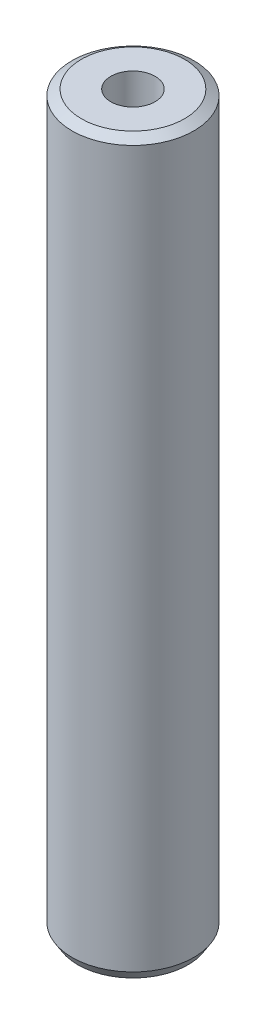
ISO-10303-21;
HEADER;
FILE_DESCRIPTION(('STEP AP214'),'2;1');
FILE_NAME('part.step','',(''),(''),'','','');
FILE_SCHEMA(('AUTOMOTIVE_DESIGN { 1 0 10303 214 1 1 1 1 }'));
ENDSEC;
DATA;
#1=APPLICATION_CONTEXT('core data for automotive mechanical design processes');
#2=APPLICATION_PROTOCOL_DEFINITION('international standard','automotive_design',2000,#1);
#3=PRODUCT_CONTEXT('',#1,'mechanical');
#4=PRODUCT('Part','Part','',(#3));
#5=PRODUCT_RELATED_PRODUCT_CATEGORY('part','',(#4));
#6=PRODUCT_DEFINITION_FORMATION('','',#4);
#7=PRODUCT_DEFINITION_CONTEXT('part definition',#1,'design');
#8=PRODUCT_DEFINITION('design','',#6,#7);
#9=PRODUCT_DEFINITION_SHAPE('','',#8);
#10=(LENGTH_UNIT() NAMED_UNIT(*) SI_UNIT(.MILLI.,.METRE.));
#11=(NAMED_UNIT(*) PLANE_ANGLE_UNIT() SI_UNIT($,.RADIAN.));
#12=(NAMED_UNIT(*) SI_UNIT($,.STERADIAN.) SOLID_ANGLE_UNIT());
#13=UNCERTAINTY_MEASURE_WITH_UNIT(LENGTH_MEASURE(1.E-05),#10,'distance_accuracy_value','');
#14=(GEOMETRIC_REPRESENTATION_CONTEXT(3) GLOBAL_UNCERTAINTY_ASSIGNED_CONTEXT((#13)) GLOBAL_UNIT_ASSIGNED_CONTEXT((#10,
#11,#12)) REPRESENTATION_CONTEXT('',''));
#15=CARTESIAN_POINT('',(0.,0.,0.));
#16=DIRECTION('',(0.,0.,1.));
#17=DIRECTION('',(1.,0.,0.));
#18=AXIS2_PLACEMENT_3D('',#15,#16,#17);
#19=CARTESIAN_POINT('',(0.,600.,0.));
#20=DIRECTION('',(0.,-1.,0.));
#21=DIRECTION('',(0.,0.,-1.));
#22=AXIS2_PLACEMENT_3D('',#19,#20,#21);
#23=CYLINDRICAL_SURFACE('',#22,50.);
#24=CARTESIAN_POINT('',(0.,595.227838809835,0.));
#25=DIRECTION('',(0.,1.,0.));
#26=DIRECTION('',(0.,0.,1.));
#27=AXIS2_PLACEMENT_3D('',#24,#25,#26);
#28=CIRCLE('',#27,50.);
#29=CARTESIAN_POINT('',(0.,595.227838809835,50.));
#30=VERTEX_POINT('',#29);
#31=EDGE_CURVE('E50',#30,#30,#28,.F.);
#32=ORIENTED_EDGE('',*,*,#31,.T.);
#33=EDGE_LOOP('',(#32));
#34=FACE_BOUND('',#33,.T.);
#35=CARTESIAN_POINT('',(0.,7.67058723065217,0.));
#36=DIRECTION('',(0.,1.,0.));
#37=DIRECTION('',(0.,0.,1.));
#38=AXIS2_PLACEMENT_3D('',#35,#36,#37);
#39=CIRCLE('',#38,50.);
#40=CARTESIAN_POINT('',(0.,7.67058723065217,50.));
#41=VERTEX_POINT('',#40);
#42=EDGE_CURVE('E51',#41,#41,#39,.T.);
#43=ORIENTED_EDGE('',*,*,#42,.T.);
#44=EDGE_LOOP('',(#43));
#45=FACE_BOUND('',#44,.T.);
#46=ADVANCED_FACE('F39',(#34,#45),#23,.T.);
#47=CARTESIAN_POINT('',(0.,600.,0.));
#48=DIRECTION('',(0.,1.,0.));
#49=DIRECTION('',(0.,0.,1.));
#50=AXIS2_PLACEMENT_3D('',#47,#48,#49);
#51=PLANE('',#50);
#52=CARTESIAN_POINT('',(0.,600.,0.));
#53=DIRECTION('',(0.,1.,0.));
#54=DIRECTION('',(0.,0.,1.));
#55=AXIS2_PLACEMENT_3D('',#52,#53,#54);
#56=CIRCLE('',#55,42.3294127693475);
#57=CARTESIAN_POINT('',(0.,600.,42.3294127693475));
#58=VERTEX_POINT('',#57);
#59=EDGE_CURVE('E54',#58,#58,#56,.T.);
#60=ORIENTED_EDGE('',*,*,#59,.T.);
#61=EDGE_LOOP('',(#60));
#62=FACE_BOUND('',#61,.T.);
#63=CARTESIAN_POINT('',(0.,600.,0.));
#64=DIRECTION('',(0.,1.,0.));
#65=DIRECTION('',(0.,0.,1.));
#66=AXIS2_PLACEMENT_3D('',#63,#64,#65);
#67=CIRCLE('',#66,18.1611144088573);
#68=CARTESIAN_POINT('',(0.,600.,18.1611144088573));
#69=VERTEX_POINT('',#68);
#70=EDGE_CURVE('E58',#69,#69,#67,.T.);
#71=ORIENTED_EDGE('',*,*,#70,.F.);
#72=EDGE_LOOP('',(#71));
#73=FACE_BOUND('',#72,.T.);
#74=ADVANCED_FACE('F69',(#62,#73),#51,.T.);
#75=CARTESIAN_POINT('',(0.,0.,0.));
#76=DIRECTION('',(0.,1.,0.));
#77=DIRECTION('',(0.,0.,1.));
#78=AXIS2_PLACEMENT_3D('',#75,#76,#77);
#79=PLANE('',#78);
#80=CARTESIAN_POINT('',(0.,0.,0.));
#81=DIRECTION('',(0.,1.,0.));
#82=DIRECTION('',(0.,0.,1.));
#83=AXIS2_PLACEMENT_3D('',#80,#81,#82);
#84=CIRCLE('',#83,45.2278388098354);
#85=CARTESIAN_POINT('',(0.,0.,45.2278388098354));
#86=VERTEX_POINT('',#85);
#87=EDGE_CURVE('E10',#86,#86,#84,.F.);
#88=ORIENTED_EDGE('',*,*,#87,.T.);
#89=EDGE_LOOP('',(#88));
#90=FACE_BOUND('',#89,.T.);
#91=CARTESIAN_POINT('',(0.,0.,0.));
#92=DIRECTION('',(0.,1.,0.));
#93=DIRECTION('',(0.,0.,1.));
#94=AXIS2_PLACEMENT_3D('',#91,#92,#93);
#95=CIRCLE('',#94,18.1611144088573);
#96=CARTESIAN_POINT('',(0.,0.,18.1611144088573));
#97=VERTEX_POINT('',#96);
#98=EDGE_CURVE('E63',#97,#97,#95,.T.);
#99=ORIENTED_EDGE('',*,*,#98,.T.);
#100=EDGE_LOOP('',(#99));
#101=FACE_BOUND('',#100,.T.);
#102=ADVANCED_FACE('F75',(#90,#101),#79,.F.);
#103=CARTESIAN_POINT('',(0.,600.,0.));
#104=DIRECTION('',(0.,-1.,0.));
#105=DIRECTION('',(0.,0.,-1.));
#106=AXIS2_PLACEMENT_3D('',#103,#104,#105);
#107=CYLINDRICAL_SURFACE('',#106,18.1611144088573);
#108=ORIENTED_EDGE('',*,*,#70,.T.);
#109=EDGE_LOOP('',(#108));
#110=FACE_BOUND('',#109,.T.);
#111=ORIENTED_EDGE('',*,*,#98,.F.);
#112=EDGE_LOOP('',(#111));
#113=FACE_BOUND('',#112,.T.);
#114=ADVANCED_FACE('F70',(#110,#113),#107,.F.);
#115=CARTESIAN_POINT('',(0.,600.,0.));
#116=DIRECTION('',(0.,-1.,0.));
#117=DIRECTION('',(0.,0.,-1.));
#118=AXIS2_PLACEMENT_3D('',#115,#116,#117);
#119=CONICAL_SURFACE('',#118,42.3294127693475,1.01425797179103);
#120=ORIENTED_EDGE('',*,*,#31,.F.);
#121=EDGE_LOOP('',(#120));
#122=FACE_BOUND('',#121,.T.);
#123=ORIENTED_EDGE('',*,*,#59,.F.);
#124=EDGE_LOOP('',(#123));
#125=FACE_BOUND('',#124,.T.);
#126=ADVANCED_FACE('F81',(#122,#125),#119,.T.);
#127=CARTESIAN_POINT('',(0.,7.67058723065217,0.));
#128=DIRECTION('',(0.,1.,0.));
#129=DIRECTION('',(0.,0.,1.));
#130=AXIS2_PLACEMENT_3D('',#127,#128,#129);
#131=CONICAL_SURFACE('',#130,50.,0.556538355003863);
#132=ORIENTED_EDGE('',*,*,#87,.F.);
#133=EDGE_LOOP('',(#132));
#134=FACE_BOUND('',#133,.T.);
#135=ORIENTED_EDGE('',*,*,#42,.F.);
#136=EDGE_LOOP('',(#135));
#137=FACE_BOUND('',#136,.T.);
#138=ADVANCED_FACE('F45',(#134,#137),#131,.T.);
#139=CLOSED_SHELL('',(#46,#74,#102,#114,#126,#138));
#140=MANIFOLD_SOLID_BREP('B2',#139);
#141=ADVANCED_BREP_SHAPE_REPRESENTATION('',(#18,#140),#14);
#142=SHAPE_DEFINITION_REPRESENTATION(#9,#141);
ENDSEC;
END-ISO-10303-21;
